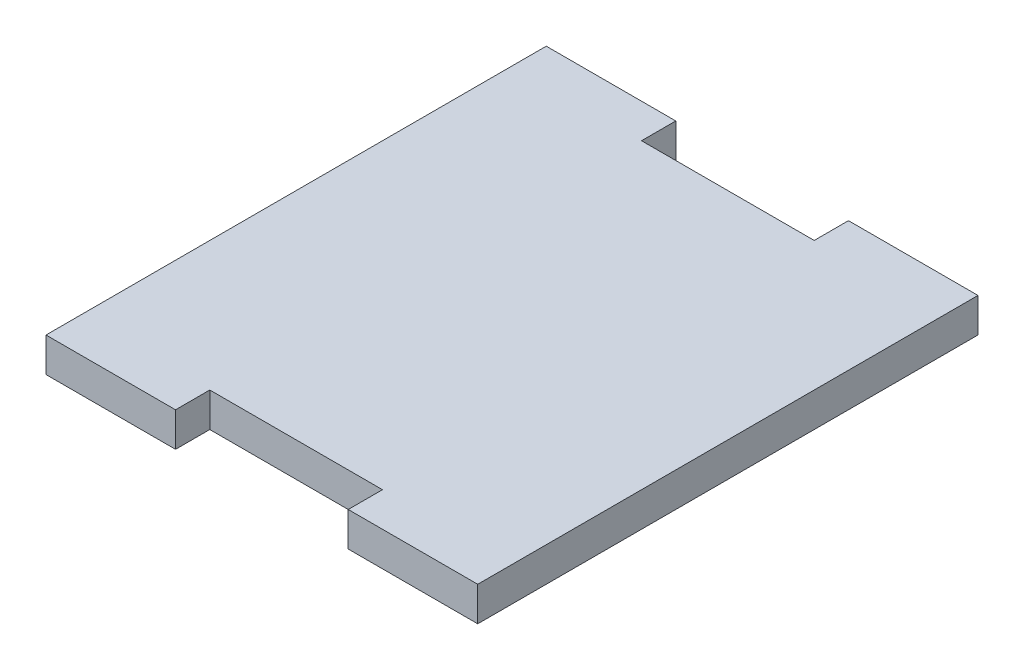
ISO-10303-21;
HEADER;
FILE_DESCRIPTION(('STEP AP214'),'2;1');
FILE_NAME('part.step','',(''),(''),'','','');
FILE_SCHEMA(('AUTOMOTIVE_DESIGN { 1 0 10303 214 1 1 1 1 }'));
ENDSEC;
DATA;
#1=APPLICATION_CONTEXT('core data for automotive mechanical design processes');
#2=APPLICATION_PROTOCOL_DEFINITION('international standard','automotive_design',2000,#1);
#3=PRODUCT_CONTEXT('',#1,'mechanical');
#4=PRODUCT('Part','Part','',(#3));
#5=PRODUCT_RELATED_PRODUCT_CATEGORY('part','',(#4));
#6=PRODUCT_DEFINITION_FORMATION('','',#4);
#7=PRODUCT_DEFINITION_CONTEXT('part definition',#1,'design');
#8=PRODUCT_DEFINITION('design','',#6,#7);
#9=PRODUCT_DEFINITION_SHAPE('','',#8);
#10=(LENGTH_UNIT() NAMED_UNIT(*) SI_UNIT(.MILLI.,.METRE.));
#11=(NAMED_UNIT(*) PLANE_ANGLE_UNIT() SI_UNIT($,.RADIAN.));
#12=(NAMED_UNIT(*) SI_UNIT($,.STERADIAN.) SOLID_ANGLE_UNIT());
#13=UNCERTAINTY_MEASURE_WITH_UNIT(LENGTH_MEASURE(1.E-05),#10,'distance_accuracy_value','');
#14=(GEOMETRIC_REPRESENTATION_CONTEXT(3) GLOBAL_UNCERTAINTY_ASSIGNED_CONTEXT((#13)) GLOBAL_UNIT_ASSIGNED_CONTEXT((#10,
#11,#12)) REPRESENTATION_CONTEXT('',''));
#15=CARTESIAN_POINT('',(0.,0.,0.));
#16=DIRECTION('',(0.,0.,1.));
#17=DIRECTION('',(1.,0.,0.));
#18=AXIS2_PLACEMENT_3D('',#15,#16,#17);
#19=CARTESIAN_POINT('',(-25.5302013422819,3.175,-31.4971476510067));
#20=DIRECTION('',(1.,0.,0.));
#21=DIRECTION('',(0.,0.,-1.));
#22=AXIS2_PLACEMENT_3D('',#19,#20,#21);
#23=PLANE('',#22);
#24=DIRECTION('',(0.,0.,1.));
#25=VECTOR('',#24,1.);
#26=CARTESIAN_POINT('',(-25.5302013422819,0.,-31.4971476510067));
#27=LINE('',#26,#25);
#28=CARTESIAN_POINT('',(-25.5302013422819,0.,-31.4971476510067));
#29=VERTEX_POINT('',#28);
#30=CARTESIAN_POINT('',(-25.5302013422819,0.,14.8528523489933));
#31=VERTEX_POINT('',#30);
#32=EDGE_CURVE('E246',#29,#31,#27,.T.);
#33=ORIENTED_EDGE('',*,*,#32,.T.);
#34=DIRECTION('',(0.,-1.,0.));
#35=VECTOR('',#34,1.);
#36=CARTESIAN_POINT('',(-25.5302013422819,3.175,14.8528523489933));
#37=LINE('',#36,#35);
#38=CARTESIAN_POINT('',(-25.5302013422819,3.175,14.8528523489933));
#39=VERTEX_POINT('',#38);
#40=EDGE_CURVE('E12',#39,#31,#37,.T.);
#41=ORIENTED_EDGE('',*,*,#40,.F.);
#42=DIRECTION('',(0.,0.,1.));
#43=VECTOR('',#42,1.);
#44=CARTESIAN_POINT('',(-25.5302013422819,3.175,-31.4971476510067));
#45=LINE('',#44,#43);
#46=CARTESIAN_POINT('',(-25.5302013422819,3.175,-31.4971476510067));
#47=VERTEX_POINT('',#46);
#48=EDGE_CURVE('E199',#47,#39,#45,.T.);
#49=ORIENTED_EDGE('',*,*,#48,.F.);
#50=DIRECTION('',(0.,-1.,0.));
#51=VECTOR('',#50,1.);
#52=CARTESIAN_POINT('',(-25.5302013422819,3.175,-31.4971476510067));
#53=LINE('',#52,#51);
#54=EDGE_CURVE('E155',#47,#29,#53,.T.);
#55=ORIENTED_EDGE('',*,*,#54,.T.);
#56=EDGE_LOOP('',(#33,#41,#49,#55));
#57=FACE_BOUND('',#56,.T.);
#58=ADVANCED_FACE('F36',(#57),#23,.F.);
#59=CARTESIAN_POINT('',(-25.5302013422819,3.175,14.8528523489933));
#60=DIRECTION('',(0.,0.,-1.));
#61=DIRECTION('',(-1.,0.,0.));
#62=AXIS2_PLACEMENT_3D('',#59,#60,#61);
#63=PLANE('',#62);
#64=DIRECTION('',(1.,0.,0.));
#65=VECTOR('',#64,1.);
#66=CARTESIAN_POINT('',(-25.5302013422819,0.,14.8528523489933));
#67=LINE('',#66,#65);
#68=CARTESIAN_POINT('',(-13.5302013422819,0.,14.8528523489933));
#69=VERTEX_POINT('',#68);
#70=EDGE_CURVE('E240',#31,#69,#67,.T.);
#71=ORIENTED_EDGE('',*,*,#70,.T.);
#72=DIRECTION('',(0.,-1.,0.));
#73=VECTOR('',#72,1.);
#74=CARTESIAN_POINT('',(-13.5302013422819,3.175,14.8528523489933));
#75=LINE('',#74,#73);
#76=CARTESIAN_POINT('',(-13.5302013422819,3.175,14.8528523489933));
#77=VERTEX_POINT('',#76);
#78=EDGE_CURVE('E44',#77,#69,#75,.T.);
#79=ORIENTED_EDGE('',*,*,#78,.F.);
#80=DIRECTION('',(1.,0.,0.));
#81=VECTOR('',#80,1.);
#82=CARTESIAN_POINT('',(-25.5302013422819,3.175,14.8528523489933));
#83=LINE('',#82,#81);
#84=EDGE_CURVE('E107',#39,#77,#83,.T.);
#85=ORIENTED_EDGE('',*,*,#84,.F.);
#86=ORIENTED_EDGE('',*,*,#40,.T.);
#87=EDGE_LOOP('',(#71,#79,#85,#86));
#88=FACE_BOUND('',#87,.T.);
#89=ADVANCED_FACE('F275',(#88),#63,.F.);
#90=CARTESIAN_POINT('',(-13.5302013422819,3.175,14.8528523489933));
#91=DIRECTION('',(-1.,0.,0.));
#92=DIRECTION('',(0.,0.,1.));
#93=AXIS2_PLACEMENT_3D('',#90,#91,#92);
#94=PLANE('',#93);
#95=DIRECTION('',(0.,0.,-1.));
#96=VECTOR('',#95,1.);
#97=CARTESIAN_POINT('',(-13.5302013422819,0.,14.8528523489933));
#98=LINE('',#97,#96);
#99=CARTESIAN_POINT('',(-13.5302013422819,0.,11.6778523489933));
#100=VERTEX_POINT('',#99);
#101=EDGE_CURVE('E235',#69,#100,#98,.T.);
#102=ORIENTED_EDGE('',*,*,#101,.T.);
#103=DIRECTION('',(0.,-1.,0.));
#104=VECTOR('',#103,1.);
#105=CARTESIAN_POINT('',(-13.5302013422819,3.175,11.6778523489933));
#106=LINE('',#105,#104);
#107=CARTESIAN_POINT('',(-13.5302013422819,3.175,11.6778523489933));
#108=VERTEX_POINT('',#107);
#109=EDGE_CURVE('E227',#108,#100,#106,.T.);
#110=ORIENTED_EDGE('',*,*,#109,.F.);
#111=DIRECTION('',(0.,0.,-1.));
#112=VECTOR('',#111,1.);
#113=CARTESIAN_POINT('',(-13.5302013422819,3.175,14.8528523489933));
#114=LINE('',#113,#112);
#115=EDGE_CURVE('E191',#77,#108,#114,.T.);
#116=ORIENTED_EDGE('',*,*,#115,.F.);
#117=ORIENTED_EDGE('',*,*,#78,.T.);
#118=EDGE_LOOP('',(#102,#110,#116,#117));
#119=FACE_BOUND('',#118,.T.);
#120=ADVANCED_FACE('F233',(#119),#94,.F.);
#121=CARTESIAN_POINT('',(-13.5302013422819,3.175,11.6778523489933));
#122=DIRECTION('',(0.,0.,-1.));
#123=DIRECTION('',(-1.,0.,0.));
#124=AXIS2_PLACEMENT_3D('',#121,#122,#123);
#125=PLANE('',#124);
#126=DIRECTION('',(1.,0.,0.));
#127=VECTOR('',#126,1.);
#128=CARTESIAN_POINT('',(-13.5302013422819,0.,11.6778523489933));
#129=LINE('',#128,#127);
#130=CARTESIAN_POINT('',(2.46979865771813,0.,11.6778523489933));
#131=VERTEX_POINT('',#130);
#132=EDGE_CURVE('E242',#100,#131,#129,.T.);
#133=ORIENTED_EDGE('',*,*,#132,.T.);
#134=DIRECTION('',(0.,-1.,0.));
#135=VECTOR('',#134,1.);
#136=CARTESIAN_POINT('',(2.46979865771813,3.175,11.6778523489933));
#137=LINE('',#136,#135);
#138=CARTESIAN_POINT('',(2.46979865771813,3.175,11.6778523489933));
#139=VERTEX_POINT('',#138);
#140=EDGE_CURVE('E224',#139,#131,#137,.T.);
#141=ORIENTED_EDGE('',*,*,#140,.F.);
#142=DIRECTION('',(1.,0.,0.));
#143=VECTOR('',#142,1.);
#144=CARTESIAN_POINT('',(-13.5302013422819,3.175,11.6778523489933));
#145=LINE('',#144,#143);
#146=EDGE_CURVE('E187',#108,#139,#145,.T.);
#147=ORIENTED_EDGE('',*,*,#146,.F.);
#148=ORIENTED_EDGE('',*,*,#109,.T.);
#149=EDGE_LOOP('',(#133,#141,#147,#148));
#150=FACE_BOUND('',#149,.T.);
#151=ADVANCED_FACE('F282',(#150),#125,.F.);
#152=CARTESIAN_POINT('',(2.46979865771813,3.175,11.6778523489933));
#153=DIRECTION('',(1.,0.,0.));
#154=DIRECTION('',(0.,0.,-1.));
#155=AXIS2_PLACEMENT_3D('',#152,#153,#154);
#156=PLANE('',#155);
#157=DIRECTION('',(0.,0.,1.));
#158=VECTOR('',#157,1.);
#159=CARTESIAN_POINT('',(2.46979865771813,0.,11.6778523489933));
#160=LINE('',#159,#158);
#161=CARTESIAN_POINT('',(2.46979865771813,0.,14.8528523489933));
#162=VERTEX_POINT('',#161);
#163=EDGE_CURVE('E244',#131,#162,#160,.T.);
#164=ORIENTED_EDGE('',*,*,#163,.T.);
#165=DIRECTION('',(0.,-1.,0.));
#166=VECTOR('',#165,1.);
#167=CARTESIAN_POINT('',(2.46979865771813,3.175,14.8528523489933));
#168=LINE('',#167,#166);
#169=CARTESIAN_POINT('',(2.46979865771813,3.175,14.8528523489933));
#170=VERTEX_POINT('',#169);
#171=EDGE_CURVE('E221',#170,#162,#168,.T.);
#172=ORIENTED_EDGE('',*,*,#171,.F.);
#173=DIRECTION('',(0.,0.,1.));
#174=VECTOR('',#173,1.);
#175=CARTESIAN_POINT('',(2.46979865771813,3.175,11.6778523489933));
#176=LINE('',#175,#174);
#177=EDGE_CURVE('E184',#139,#170,#176,.T.);
#178=ORIENTED_EDGE('',*,*,#177,.F.);
#179=ORIENTED_EDGE('',*,*,#140,.T.);
#180=EDGE_LOOP('',(#164,#172,#178,#179));
#181=FACE_BOUND('',#180,.T.);
#182=ADVANCED_FACE('F287',(#181),#156,.F.);
#183=CARTESIAN_POINT('',(2.46979865771813,3.175,14.8528523489933));
#184=DIRECTION('',(0.,0.,-1.));
#185=DIRECTION('',(-1.,0.,0.));
#186=AXIS2_PLACEMENT_3D('',#183,#184,#185);
#187=PLANE('',#186);
#188=DIRECTION('',(1.,0.,0.));
#189=VECTOR('',#188,1.);
#190=CARTESIAN_POINT('',(2.46979865771813,0.,14.8528523489933));
#191=LINE('',#190,#189);
#192=CARTESIAN_POINT('',(14.4697986577181,0.,14.8528523489933));
#193=VERTEX_POINT('',#192);
#194=EDGE_CURVE('E250',#162,#193,#191,.T.);
#195=ORIENTED_EDGE('',*,*,#194,.T.);
#196=DIRECTION('',(0.,-1.,0.));
#197=VECTOR('',#196,1.);
#198=CARTESIAN_POINT('',(14.4697986577181,3.175,14.8528523489933));
#199=LINE('',#198,#197);
#200=CARTESIAN_POINT('',(14.4697986577181,3.175,14.8528523489933));
#201=VERTEX_POINT('',#200);
#202=EDGE_CURVE('E218',#201,#193,#199,.T.);
#203=ORIENTED_EDGE('',*,*,#202,.F.);
#204=DIRECTION('',(1.,0.,0.));
#205=VECTOR('',#204,1.);
#206=CARTESIAN_POINT('',(2.46979865771813,3.175,14.8528523489933));
#207=LINE('',#206,#205);
#208=EDGE_CURVE('E176',#170,#201,#207,.T.);
#209=ORIENTED_EDGE('',*,*,#208,.F.);
#210=ORIENTED_EDGE('',*,*,#171,.T.);
#211=EDGE_LOOP('',(#195,#203,#209,#210));
#212=FACE_BOUND('',#211,.T.);
#213=ADVANCED_FACE('F291',(#212),#187,.F.);
#214=CARTESIAN_POINT('',(14.4697986577181,3.175,14.8528523489933));
#215=DIRECTION('',(-1.,0.,0.));
#216=DIRECTION('',(0.,0.,1.));
#217=AXIS2_PLACEMENT_3D('',#214,#215,#216);
#218=PLANE('',#217);
#219=DIRECTION('',(0.,0.,-1.));
#220=VECTOR('',#219,1.);
#221=CARTESIAN_POINT('',(14.4697986577181,0.,14.8528523489933));
#222=LINE('',#221,#220);
#223=CARTESIAN_POINT('',(14.4697986577181,0.,-31.4971476510067));
#224=VERTEX_POINT('',#223);
#225=EDGE_CURVE('E252',#193,#224,#222,.T.);
#226=ORIENTED_EDGE('',*,*,#225,.T.);
#227=DIRECTION('',(0.,-1.,0.));
#228=VECTOR('',#227,1.);
#229=CARTESIAN_POINT('',(14.4697986577181,3.175,-31.4971476510067));
#230=LINE('',#229,#228);
#231=CARTESIAN_POINT('',(14.4697986577181,3.175,-31.4971476510067));
#232=VERTEX_POINT('',#231);
#233=EDGE_CURVE('E215',#232,#224,#230,.T.);
#234=ORIENTED_EDGE('',*,*,#233,.F.);
#235=DIRECTION('',(0.,0.,-1.));
#236=VECTOR('',#235,1.);
#237=CARTESIAN_POINT('',(14.4697986577181,3.175,14.8528523489933));
#238=LINE('',#237,#236);
#239=EDGE_CURVE('E172',#201,#232,#238,.T.);
#240=ORIENTED_EDGE('',*,*,#239,.F.);
#241=ORIENTED_EDGE('',*,*,#202,.T.);
#242=EDGE_LOOP('',(#226,#234,#240,#241));
#243=FACE_BOUND('',#242,.T.);
#244=ADVANCED_FACE('F295',(#243),#218,.F.);
#245=CARTESIAN_POINT('',(14.4697986577181,3.175,-31.4971476510067));
#246=DIRECTION('',(0.,0.,1.));
#247=DIRECTION('',(1.,0.,0.));
#248=AXIS2_PLACEMENT_3D('',#245,#246,#247);
#249=PLANE('',#248);
#250=DIRECTION('',(-1.,0.,0.));
#251=VECTOR('',#250,1.);
#252=CARTESIAN_POINT('',(14.4697986577181,0.,-31.4971476510067));
#253=LINE('',#252,#251);
#254=CARTESIAN_POINT('',(2.46979865771813,0.,-31.4971476510067));
#255=VERTEX_POINT('',#254);
#256=EDGE_CURVE('E254',#224,#255,#253,.T.);
#257=ORIENTED_EDGE('',*,*,#256,.T.);
#258=DIRECTION('',(0.,-1.,0.));
#259=VECTOR('',#258,1.);
#260=CARTESIAN_POINT('',(2.46979865771813,3.175,-31.4971476510067));
#261=LINE('',#260,#259);
#262=CARTESIAN_POINT('',(2.46979865771813,3.175,-31.4971476510067));
#263=VERTEX_POINT('',#262);
#264=EDGE_CURVE('E212',#263,#255,#261,.T.);
#265=ORIENTED_EDGE('',*,*,#264,.F.);
#266=DIRECTION('',(-1.,0.,0.));
#267=VECTOR('',#266,1.);
#268=CARTESIAN_POINT('',(14.4697986577181,3.175,-31.4971476510067));
#269=LINE('',#268,#267);
#270=EDGE_CURVE('E168',#232,#263,#269,.T.);
#271=ORIENTED_EDGE('',*,*,#270,.F.);
#272=ORIENTED_EDGE('',*,*,#233,.T.);
#273=EDGE_LOOP('',(#257,#265,#271,#272));
#274=FACE_BOUND('',#273,.T.);
#275=ADVANCED_FACE('F299',(#274),#249,.F.);
#276=CARTESIAN_POINT('',(2.46979865771813,3.175,-31.4971476510067));
#277=DIRECTION('',(1.,0.,0.));
#278=DIRECTION('',(0.,0.,-1.));
#279=AXIS2_PLACEMENT_3D('',#276,#277,#278);
#280=PLANE('',#279);
#281=DIRECTION('',(0.,0.,1.));
#282=VECTOR('',#281,1.);
#283=CARTESIAN_POINT('',(2.46979865771813,0.,-31.4971476510067));
#284=LINE('',#283,#282);
#285=CARTESIAN_POINT('',(2.46979865771813,0.,-28.3221476510067));
#286=VERTEX_POINT('',#285);
#287=EDGE_CURVE('E256',#255,#286,#284,.T.);
#288=ORIENTED_EDGE('',*,*,#287,.T.);
#289=DIRECTION('',(0.,-1.,0.));
#290=VECTOR('',#289,1.);
#291=CARTESIAN_POINT('',(2.46979865771813,3.175,-28.3221476510067));
#292=LINE('',#291,#290);
#293=CARTESIAN_POINT('',(2.46979865771813,3.175,-28.3221476510067));
#294=VERTEX_POINT('',#293);
#295=EDGE_CURVE('E148',#294,#286,#292,.T.);
#296=ORIENTED_EDGE('',*,*,#295,.F.);
#297=DIRECTION('',(0.,0.,1.));
#298=VECTOR('',#297,1.);
#299=CARTESIAN_POINT('',(2.46979865771813,3.175,-31.4971476510067));
#300=LINE('',#299,#298);
#301=EDGE_CURVE('E138',#263,#294,#300,.T.);
#302=ORIENTED_EDGE('',*,*,#301,.F.);
#303=ORIENTED_EDGE('',*,*,#264,.T.);
#304=EDGE_LOOP('',(#288,#296,#302,#303));
#305=FACE_BOUND('',#304,.T.);
#306=ADVANCED_FACE('F259',(#305),#280,.F.);
#307=CARTESIAN_POINT('',(2.46979865771813,3.175,-28.3221476510067));
#308=DIRECTION('',(0.,0.,1.));
#309=DIRECTION('',(1.,0.,0.));
#310=AXIS2_PLACEMENT_3D('',#307,#308,#309);
#311=PLANE('',#310);
#312=DIRECTION('',(-1.,0.,0.));
#313=VECTOR('',#312,1.);
#314=CARTESIAN_POINT('',(2.46979865771813,0.,-28.3221476510067));
#315=LINE('',#314,#313);
#316=CARTESIAN_POINT('',(-13.5302013422819,0.,-28.3221476510067));
#317=VERTEX_POINT('',#316);
#318=EDGE_CURVE('E147',#286,#317,#315,.T.);
#319=ORIENTED_EDGE('',*,*,#318,.T.);
#320=DIRECTION('',(0.,-1.,0.));
#321=VECTOR('',#320,1.);
#322=CARTESIAN_POINT('',(-13.5302013422819,3.175,-28.3221476510067));
#323=LINE('',#322,#321);
#324=CARTESIAN_POINT('',(-13.5302013422819,3.175,-28.3221476510067));
#325=VERTEX_POINT('',#324);
#326=EDGE_CURVE('E144',#325,#317,#323,.T.);
#327=ORIENTED_EDGE('',*,*,#326,.F.);
#328=DIRECTION('',(-1.,0.,0.));
#329=VECTOR('',#328,1.);
#330=CARTESIAN_POINT('',(2.46979865771813,3.175,-28.3221476510067));
#331=LINE('',#330,#329);
#332=EDGE_CURVE('E132',#294,#325,#331,.T.);
#333=ORIENTED_EDGE('',*,*,#332,.F.);
#334=ORIENTED_EDGE('',*,*,#295,.T.);
#335=EDGE_LOOP('',(#319,#327,#333,#334));
#336=FACE_BOUND('',#335,.T.);
#337=ADVANCED_FACE('F145',(#336),#311,.F.);
#338=CARTESIAN_POINT('',(-13.5302013422819,3.175,-28.3221476510067));
#339=DIRECTION('',(-1.,0.,0.));
#340=DIRECTION('',(0.,0.,1.));
#341=AXIS2_PLACEMENT_3D('',#338,#339,#340);
#342=PLANE('',#341);
#343=DIRECTION('',(0.,0.,-1.));
#344=VECTOR('',#343,1.);
#345=CARTESIAN_POINT('',(-13.5302013422819,0.,-28.3221476510067));
#346=LINE('',#345,#344);
#347=CARTESIAN_POINT('',(-13.5302013422819,0.,-31.4971476510067));
#348=VERTEX_POINT('',#347);
#349=EDGE_CURVE('E93',#317,#348,#346,.T.);
#350=ORIENTED_EDGE('',*,*,#349,.T.);
#351=DIRECTION('',(0.,-1.,0.));
#352=VECTOR('',#351,1.);
#353=CARTESIAN_POINT('',(-13.5302013422819,3.175,-31.4971476510067));
#354=LINE('',#353,#352);
#355=CARTESIAN_POINT('',(-13.5302013422819,3.175,-31.4971476510067));
#356=VERTEX_POINT('',#355);
#357=EDGE_CURVE('E149',#356,#348,#354,.T.);
#358=ORIENTED_EDGE('',*,*,#357,.F.);
#359=DIRECTION('',(0.,0.,-1.));
#360=VECTOR('',#359,1.);
#361=CARTESIAN_POINT('',(-13.5302013422819,3.175,-28.3221476510067));
#362=LINE('',#361,#360);
#363=EDGE_CURVE('E136',#325,#356,#362,.T.);
#364=ORIENTED_EDGE('',*,*,#363,.F.);
#365=ORIENTED_EDGE('',*,*,#326,.T.);
#366=EDGE_LOOP('',(#350,#358,#364,#365));
#367=FACE_BOUND('',#366,.T.);
#368=ADVANCED_FACE('F151',(#367),#342,.F.);
#369=CARTESIAN_POINT('',(-13.5302013422819,3.175,-31.4971476510067));
#370=DIRECTION('',(0.,0.,1.));
#371=DIRECTION('',(1.,0.,0.));
#372=AXIS2_PLACEMENT_3D('',#369,#370,#371);
#373=PLANE('',#372);
#374=DIRECTION('',(-1.,0.,0.));
#375=VECTOR('',#374,1.);
#376=CARTESIAN_POINT('',(-13.5302013422819,0.,-31.4971476510067));
#377=LINE('',#376,#375);
#378=EDGE_CURVE('E99',#348,#29,#377,.T.);
#379=ORIENTED_EDGE('',*,*,#378,.T.);
#380=ORIENTED_EDGE('',*,*,#54,.F.);
#381=DIRECTION('',(-1.,0.,0.));
#382=VECTOR('',#381,1.);
#383=CARTESIAN_POINT('',(-13.5302013422819,3.175,-31.4971476510067));
#384=LINE('',#383,#382);
#385=EDGE_CURVE('E52',#356,#47,#384,.T.);
#386=ORIENTED_EDGE('',*,*,#385,.F.);
#387=ORIENTED_EDGE('',*,*,#357,.T.);
#388=EDGE_LOOP('',(#379,#380,#386,#387));
#389=FACE_BOUND('',#388,.T.);
#390=ADVANCED_FACE('F264',(#389),#373,.F.);
#391=CARTESIAN_POINT('',(0.,3.175,0.));
#392=DIRECTION('',(0.,1.,0.));
#393=DIRECTION('',(0.,0.,1.));
#394=AXIS2_PLACEMENT_3D('',#391,#392,#393);
#395=PLANE('',#394);
#396=ORIENTED_EDGE('',*,*,#48,.T.);
#397=ORIENTED_EDGE('',*,*,#84,.T.);
#398=ORIENTED_EDGE('',*,*,#115,.T.);
#399=ORIENTED_EDGE('',*,*,#146,.T.);
#400=ORIENTED_EDGE('',*,*,#177,.T.);
#401=ORIENTED_EDGE('',*,*,#208,.T.);
#402=ORIENTED_EDGE('',*,*,#239,.T.);
#403=ORIENTED_EDGE('',*,*,#270,.T.);
#404=ORIENTED_EDGE('',*,*,#301,.T.);
#405=ORIENTED_EDGE('',*,*,#332,.T.);
#406=ORIENTED_EDGE('',*,*,#363,.T.);
#407=ORIENTED_EDGE('',*,*,#385,.T.);
#408=EDGE_LOOP('',(#396,#397,#398,#399,#400,#401,#402,#403,#404,#405,#406,#407));
#409=FACE_BOUND('',#408,.T.);
#410=ADVANCED_FACE('F134',(#409),#395,.T.);
#411=CARTESIAN_POINT('',(0.,0.,0.));
#412=DIRECTION('',(0.,1.,0.));
#413=DIRECTION('',(0.,0.,1.));
#414=AXIS2_PLACEMENT_3D('',#411,#412,#413);
#415=PLANE('',#414);
#416=ORIENTED_EDGE('',*,*,#32,.F.);
#417=ORIENTED_EDGE('',*,*,#378,.F.);
#418=ORIENTED_EDGE('',*,*,#349,.F.);
#419=ORIENTED_EDGE('',*,*,#318,.F.);
#420=ORIENTED_EDGE('',*,*,#287,.F.);
#421=ORIENTED_EDGE('',*,*,#256,.F.);
#422=ORIENTED_EDGE('',*,*,#225,.F.);
#423=ORIENTED_EDGE('',*,*,#194,.F.);
#424=ORIENTED_EDGE('',*,*,#163,.F.);
#425=ORIENTED_EDGE('',*,*,#132,.F.);
#426=ORIENTED_EDGE('',*,*,#101,.F.);
#427=ORIENTED_EDGE('',*,*,#70,.F.);
#428=EDGE_LOOP('',(#416,#417,#418,#419,#420,#421,#422,#423,#424,#425,#426,#427));
#429=FACE_BOUND('',#428,.T.);
#430=ADVANCED_FACE('F239',(#429),#415,.F.);
#431=CLOSED_SHELL('',(#58,#89,#120,#151,#182,#213,#244,#275,#306,#337,#368,#390,#410,#430));
#432=MANIFOLD_SOLID_BREP('B2',#431);
#433=ADVANCED_BREP_SHAPE_REPRESENTATION('',(#18,#432),#14);
#434=SHAPE_DEFINITION_REPRESENTATION(#9,#433);
ENDSEC;
END-ISO-10303-21;
